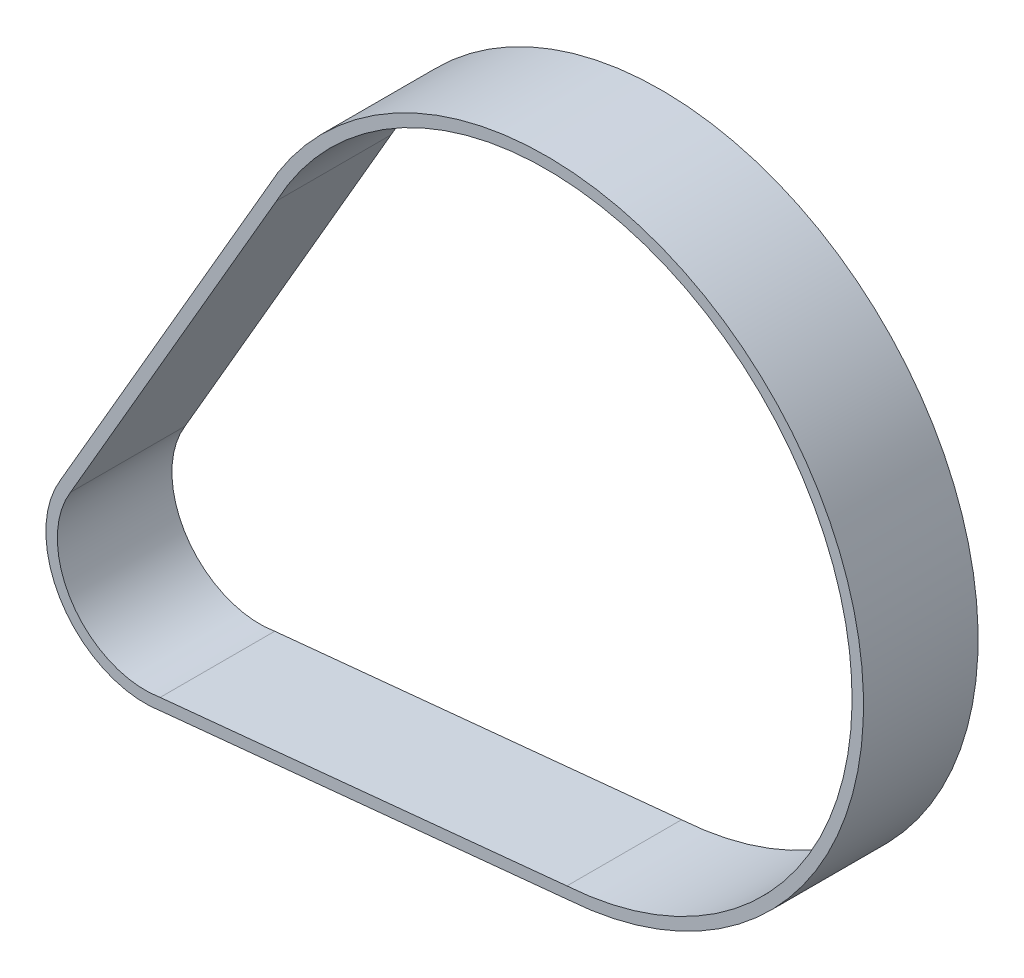
ISO-10303-21;
HEADER;
FILE_DESCRIPTION(('STEP AP214'),'2;1');
FILE_NAME('part.step','',(''),(''),'','','');
FILE_SCHEMA(('AUTOMOTIVE_DESIGN { 1 0 10303 214 1 1 1 1 }'));
ENDSEC;
DATA;
#1=APPLICATION_CONTEXT('core data for automotive mechanical design processes');
#2=APPLICATION_PROTOCOL_DEFINITION('international standard','automotive_design',2000,#1);
#3=PRODUCT_CONTEXT('',#1,'mechanical');
#4=PRODUCT('Part','Part','',(#3));
#5=PRODUCT_RELATED_PRODUCT_CATEGORY('part','',(#4));
#6=PRODUCT_DEFINITION_FORMATION('','',#4);
#7=PRODUCT_DEFINITION_CONTEXT('part definition',#1,'design');
#8=PRODUCT_DEFINITION('design','',#6,#7);
#9=PRODUCT_DEFINITION_SHAPE('','',#8);
#10=(LENGTH_UNIT() NAMED_UNIT(*) SI_UNIT(.MILLI.,.METRE.));
#11=(NAMED_UNIT(*) PLANE_ANGLE_UNIT() SI_UNIT($,.RADIAN.));
#12=(NAMED_UNIT(*) SI_UNIT($,.STERADIAN.) SOLID_ANGLE_UNIT());
#13=UNCERTAINTY_MEASURE_WITH_UNIT(LENGTH_MEASURE(1.E-05),#10,'distance_accuracy_value','');
#14=(GEOMETRIC_REPRESENTATION_CONTEXT(3) GLOBAL_UNCERTAINTY_ASSIGNED_CONTEXT((#13)) GLOBAL_UNIT_ASSIGNED_CONTEXT((#10,
#11,#12)) REPRESENTATION_CONTEXT('',''));
#15=CARTESIAN_POINT('',(0.,0.,0.));
#16=DIRECTION('',(0.,0.,1.));
#17=DIRECTION('',(1.,0.,0.));
#18=AXIS2_PLACEMENT_3D('',#15,#16,#17);
#19=CARTESIAN_POINT('',(0.,0.,15.));
#20=DIRECTION('',(0.,0.,1.));
#21=DIRECTION('',(1.,0.,0.));
#22=AXIS2_PLACEMENT_3D('',#19,#20,#21);
#23=PLANE('',#22);
#24=CARTESIAN_POINT('',(0.,0.,15.));
#25=DIRECTION('',(0.,0.,1.));
#26=DIRECTION('',(1.,0.,0.));
#27=AXIS2_PLACEMENT_3D('',#24,#25,#26);
#28=CIRCLE('',#27,13.);
#29=CARTESIAN_POINT('',(-11.0755055278816,6.80684782420347,15.));
#30=VERTEX_POINT('',#29);
#31=CARTESIAN_POINT('',(2.16100902586993,-12.8191278950679,15.));
#32=VERTEX_POINT('',#31);
#33=EDGE_CURVE('E153',#30,#32,#28,.T.);
#34=ORIENTED_EDGE('',*,*,#33,.T.);
#35=DIRECTION('',(0.995168514034322,0.0981816106749091,0.));
#36=VECTOR('',#35,1.);
#37=CARTESIAN_POINT('',(55.3313003015655,-7.57343858327584,15.));
#38=LINE('',#37,#36);
#39=CARTESIAN_POINT('',(55.3313003015655,-7.57343858327585,15.));
#40=VERTEX_POINT('',#39);
#41=EDGE_CURVE('E157',#32,#40,#38,.T.);
#42=ORIENTED_EDGE('',*,*,#41,.T.);
#43=CARTESIAN_POINT('',(52.5312535081296,33.8319926782697,15.));
#44=DIRECTION('',(0.,0.,1.));
#45=DIRECTION('',(1.,0.,0.));
#46=AXIS2_PLACEMENT_3D('',#43,#44,#45);
#47=CIRCLE('',#46,41.5);
#48=CARTESIAN_POINT('',(15.8692170701721,53.2779455791146,15.));
#49=VERTEX_POINT('',#48);
#50=EDGE_CURVE('E161',#40,#49,#47,.T.);
#51=ORIENTED_EDGE('',*,*,#50,.T.);
#52=DIRECTION('',(-0.501599484798106,-0.865099969281166,0.));
#53=VECTOR('',#52,1.);
#54=CARTESIAN_POINT('',(-11.0755055278816,6.80684782420347,15.));
#55=LINE('',#54,#53);
#56=EDGE_CURVE('E164',#49,#30,#55,.T.);
#57=ORIENTED_EDGE('',*,*,#56,.T.);
#58=EDGE_LOOP('',(#34,#42,#51,#57));
#59=FACE_BOUND('',#58,.T.);
#60=DIRECTION('',(0.995168514034322,0.0981816106749091,0.));
#61=VECTOR('',#60,1.);
#62=CARTESIAN_POINT('',(55.2072430923386,-6.0783954399284,15.));
#63=LINE('',#62,#61);
#64=CARTESIAN_POINT('',(1.96089229816123,-11.3315886527447,15.));
#65=VERTEX_POINT('',#64);
#66=CARTESIAN_POINT('',(55.2072430923386,-6.07839543992839,15.));
#67=VERTEX_POINT('',#66);
#68=EDGE_CURVE('E114',#65,#67,#63,.T.);
#69=ORIENTED_EDGE('',*,*,#68,.F.);
#70=CARTESIAN_POINT('',(0.,0.,15.));
#71=DIRECTION('',(0.,0.,1.));
#72=DIRECTION('',(1.,0.,0.));
#73=AXIS2_PLACEMENT_3D('',#70,#71,#72);
#74=CIRCLE('',#73,11.5);
#75=CARTESIAN_POINT('',(-9.78779308237401,6.03730954785585,15.));
#76=VERTEX_POINT('',#75);
#77=EDGE_CURVE('E105',#76,#65,#74,.T.);
#78=ORIENTED_EDGE('',*,*,#77,.F.);
#79=DIRECTION('',(-0.501599484798106,-0.865099969281166,0.));
#80=VECTOR('',#79,1.);
#81=CARTESIAN_POINT('',(-9.78779308237401,6.03730954785585,15.));
#82=LINE('',#81,#80);
#83=CARTESIAN_POINT('',(17.1812075336384,52.5502791810817,15.));
#84=VERTEX_POINT('',#83);
#85=EDGE_CURVE('E131',#84,#76,#82,.T.);
#86=ORIENTED_EDGE('',*,*,#85,.F.);
#87=CARTESIAN_POINT('',(52.5312535081296,33.8319926782697,15.));
#88=DIRECTION('',(0.,0.,1.));
#89=DIRECTION('',(1.,0.,0.));
#90=AXIS2_PLACEMENT_3D('',#87,#88,#89);
#91=CIRCLE('',#90,40.);
#92=EDGE_CURVE('E127',#67,#84,#91,.T.);
#93=ORIENTED_EDGE('',*,*,#92,.F.);
#94=EDGE_LOOP('',(#69,#78,#86,#93));
#95=FACE_BOUND('',#94,.T.);
#96=ADVANCED_FACE('F39',(#59,#95),#23,.T.);
#97=CARTESIAN_POINT('',(0.,0.,0.));
#98=DIRECTION('',(0.,0.,1.));
#99=DIRECTION('',(1.,0.,0.));
#100=AXIS2_PLACEMENT_3D('',#97,#98,#99);
#101=PLANE('',#100);
#102=CARTESIAN_POINT('',(0.,0.,0.));
#103=DIRECTION('',(0.,0.,1.));
#104=DIRECTION('',(1.,0.,0.));
#105=AXIS2_PLACEMENT_3D('',#102,#103,#104);
#106=CIRCLE('',#105,13.);
#107=CARTESIAN_POINT('',(-11.0755055278816,6.80684782420347,0.));
#108=VERTEX_POINT('',#107);
#109=CARTESIAN_POINT('',(2.16100902586993,-12.8191278950679,0.));
#110=VERTEX_POINT('',#109);
#111=EDGE_CURVE('E123',#108,#110,#106,.T.);
#112=ORIENTED_EDGE('',*,*,#111,.F.);
#113=DIRECTION('',(-0.501599484798106,-0.865099969281166,0.));
#114=VECTOR('',#113,1.);
#115=CARTESIAN_POINT('',(-11.0755055278816,6.80684782420347,0.));
#116=LINE('',#115,#114);
#117=CARTESIAN_POINT('',(15.8692170701721,53.2779455791146,0.));
#118=VERTEX_POINT('',#117);
#119=EDGE_CURVE('E158',#118,#108,#116,.T.);
#120=ORIENTED_EDGE('',*,*,#119,.F.);
#121=CARTESIAN_POINT('',(52.5312535081296,33.8319926782697,0.));
#122=DIRECTION('',(0.,0.,1.));
#123=DIRECTION('',(1.,0.,0.));
#124=AXIS2_PLACEMENT_3D('',#121,#122,#123);
#125=CIRCLE('',#124,41.5);
#126=CARTESIAN_POINT('',(55.3313003015655,-7.57343858327585,0.));
#127=VERTEX_POINT('',#126);
#128=EDGE_CURVE('E174',#127,#118,#125,.T.);
#129=ORIENTED_EDGE('',*,*,#128,.F.);
#130=DIRECTION('',(0.995168514034322,0.0981816106749091,0.));
#131=VECTOR('',#130,1.);
#132=CARTESIAN_POINT('',(55.3313003015655,-7.57343858327584,0.));
#133=LINE('',#132,#131);
#134=EDGE_CURVE('E171',#110,#127,#133,.T.);
#135=ORIENTED_EDGE('',*,*,#134,.F.);
#136=EDGE_LOOP('',(#112,#120,#129,#135));
#137=FACE_BOUND('',#136,.T.);
#138=CARTESIAN_POINT('',(0.,0.,0.));
#139=DIRECTION('',(0.,0.,1.));
#140=DIRECTION('',(1.,0.,0.));
#141=AXIS2_PLACEMENT_3D('',#138,#139,#140);
#142=CIRCLE('',#141,11.5);
#143=CARTESIAN_POINT('',(-9.78779308237401,6.03730954785585,0.));
#144=VERTEX_POINT('',#143);
#145=CARTESIAN_POINT('',(1.96089229816123,-11.3315886527447,0.));
#146=VERTEX_POINT('',#145);
#147=EDGE_CURVE('E63',#144,#146,#142,.T.);
#148=ORIENTED_EDGE('',*,*,#147,.T.);
#149=DIRECTION('',(0.995168514034322,0.0981816106749091,0.));
#150=VECTOR('',#149,1.);
#151=CARTESIAN_POINT('',(55.2072430923386,-6.0783954399284,0.));
#152=LINE('',#151,#150);
#153=CARTESIAN_POINT('',(55.2072430923386,-6.07839543992839,0.));
#154=VERTEX_POINT('',#153);
#155=EDGE_CURVE('E121',#146,#154,#152,.T.);
#156=ORIENTED_EDGE('',*,*,#155,.T.);
#157=CARTESIAN_POINT('',(52.5312535081296,33.8319926782697,0.));
#158=DIRECTION('',(0.,0.,1.));
#159=DIRECTION('',(1.,0.,0.));
#160=AXIS2_PLACEMENT_3D('',#157,#158,#159);
#161=CIRCLE('',#160,40.);
#162=CARTESIAN_POINT('',(17.1812075336384,52.5502791810817,0.));
#163=VERTEX_POINT('',#162);
#164=EDGE_CURVE('E140',#154,#163,#161,.T.);
#165=ORIENTED_EDGE('',*,*,#164,.T.);
#166=DIRECTION('',(-0.501599484798106,-0.865099969281166,0.));
#167=VECTOR('',#166,1.);
#168=CARTESIAN_POINT('',(-9.78779308237401,6.03730954785585,0.));
#169=LINE('',#168,#167);
#170=EDGE_CURVE('E115',#163,#144,#169,.T.);
#171=ORIENTED_EDGE('',*,*,#170,.T.);
#172=EDGE_LOOP('',(#148,#156,#165,#171));
#173=FACE_BOUND('',#172,.T.);
#174=ADVANCED_FACE('F197',(#137,#173),#101,.F.);
#175=CARTESIAN_POINT('',(0.,0.,15.));
#176=DIRECTION('',(0.,0.,-1.));
#177=DIRECTION('',(-1.,0.,0.));
#178=AXIS2_PLACEMENT_3D('',#175,#176,#177);
#179=CYLINDRICAL_SURFACE('',#178,13.);
#180=ORIENTED_EDGE('',*,*,#111,.T.);
#181=DIRECTION('',(0.,0.,-1.));
#182=VECTOR('',#181,1.);
#183=CARTESIAN_POINT('',(2.16100902586993,-12.8191278950679,15.));
#184=LINE('',#183,#182);
#185=EDGE_CURVE('E11',#32,#110,#184,.T.);
#186=ORIENTED_EDGE('',*,*,#185,.F.);
#187=ORIENTED_EDGE('',*,*,#33,.F.);
#188=DIRECTION('',(0.,0.,-1.));
#189=VECTOR('',#188,1.);
#190=CARTESIAN_POINT('',(-11.0755055278816,6.80684782420347,15.));
#191=LINE('',#190,#189);
#192=EDGE_CURVE('E167',#30,#108,#191,.T.);
#193=ORIENTED_EDGE('',*,*,#192,.T.);
#194=EDGE_LOOP('',(#180,#186,#187,#193));
#195=FACE_BOUND('',#194,.T.);
#196=ADVANCED_FACE('F41',(#195),#179,.T.);
#197=CARTESIAN_POINT('',(55.3313003015655,-7.57343858327584,15.));
#198=DIRECTION('',(-0.0981816106749091,0.995168514034322,0.));
#199=DIRECTION('',(-0.995168514034322,-0.0981816106749091,0.));
#200=AXIS2_PLACEMENT_3D('',#197,#198,#199);
#201=PLANE('',#200);
#202=ORIENTED_EDGE('',*,*,#134,.T.);
#203=DIRECTION('',(0.,0.,-1.));
#204=VECTOR('',#203,1.);
#205=CARTESIAN_POINT('',(55.3313003015655,-7.57343858327585,15.));
#206=LINE('',#205,#204);
#207=EDGE_CURVE('E48',#40,#127,#206,.T.);
#208=ORIENTED_EDGE('',*,*,#207,.F.);
#209=ORIENTED_EDGE('',*,*,#41,.F.);
#210=ORIENTED_EDGE('',*,*,#185,.T.);
#211=EDGE_LOOP('',(#202,#208,#209,#210));
#212=FACE_BOUND('',#211,.T.);
#213=ADVANCED_FACE('F207',(#212),#201,.F.);
#214=CARTESIAN_POINT('',(52.5312535081296,33.8319926782697,15.));
#215=DIRECTION('',(0.,0.,-1.));
#216=DIRECTION('',(-1.,0.,0.));
#217=AXIS2_PLACEMENT_3D('',#214,#215,#216);
#218=CYLINDRICAL_SURFACE('',#217,41.5);
#219=ORIENTED_EDGE('',*,*,#128,.T.);
#220=DIRECTION('',(0.,0.,-1.));
#221=VECTOR('',#220,1.);
#222=CARTESIAN_POINT('',(15.8692170701721,53.2779455791146,15.));
#223=LINE('',#222,#221);
#224=EDGE_CURVE('E182',#49,#118,#223,.T.);
#225=ORIENTED_EDGE('',*,*,#224,.F.);
#226=ORIENTED_EDGE('',*,*,#50,.F.);
#227=ORIENTED_EDGE('',*,*,#207,.T.);
#228=EDGE_LOOP('',(#219,#225,#226,#227));
#229=FACE_BOUND('',#228,.T.);
#230=ADVANCED_FACE('F191',(#229),#218,.T.);
#231=CARTESIAN_POINT('',(-11.0755055278816,6.80684782420347,15.));
#232=DIRECTION('',(0.865099969281166,-0.501599484798106,0.));
#233=DIRECTION('',(0.501599484798106,0.865099969281166,0.));
#234=AXIS2_PLACEMENT_3D('',#231,#232,#233);
#235=PLANE('',#234);
#236=ORIENTED_EDGE('',*,*,#119,.T.);
#237=ORIENTED_EDGE('',*,*,#192,.F.);
#238=ORIENTED_EDGE('',*,*,#56,.F.);
#239=ORIENTED_EDGE('',*,*,#224,.T.);
#240=EDGE_LOOP('',(#236,#237,#238,#239));
#241=FACE_BOUND('',#240,.T.);
#242=ADVANCED_FACE('F201',(#241),#235,.F.);
#243=CARTESIAN_POINT('',(0.,0.,15.));
#244=DIRECTION('',(0.,0.,-1.));
#245=DIRECTION('',(-1.,0.,0.));
#246=AXIS2_PLACEMENT_3D('',#243,#244,#245);
#247=CYLINDRICAL_SURFACE('',#246,11.5);
#248=ORIENTED_EDGE('',*,*,#147,.F.);
#249=DIRECTION('',(0.,0.,-1.));
#250=VECTOR('',#249,1.);
#251=CARTESIAN_POINT('',(-9.78779308237401,6.03730954785585,15.));
#252=LINE('',#251,#250);
#253=EDGE_CURVE('E109',#76,#144,#252,.T.);
#254=ORIENTED_EDGE('',*,*,#253,.F.);
#255=ORIENTED_EDGE('',*,*,#77,.T.);
#256=DIRECTION('',(0.,0.,-1.));
#257=VECTOR('',#256,1.);
#258=CARTESIAN_POINT('',(1.96089229816123,-11.3315886527447,15.));
#259=LINE('',#258,#257);
#260=EDGE_CURVE('E108',#65,#146,#259,.T.);
#261=ORIENTED_EDGE('',*,*,#260,.T.);
#262=EDGE_LOOP('',(#248,#254,#255,#261));
#263=FACE_BOUND('',#262,.T.);
#264=ADVANCED_FACE('F107',(#263),#247,.F.);
#265=CARTESIAN_POINT('',(55.2072430923386,-6.0783954399284,15.));
#266=DIRECTION('',(-0.0981816106749091,0.995168514034322,0.));
#267=DIRECTION('',(-0.995168514034322,-0.0981816106749091,0.));
#268=AXIS2_PLACEMENT_3D('',#265,#266,#267);
#269=PLANE('',#268);
#270=ORIENTED_EDGE('',*,*,#155,.F.);
#271=ORIENTED_EDGE('',*,*,#260,.F.);
#272=ORIENTED_EDGE('',*,*,#68,.T.);
#273=DIRECTION('',(0.,0.,-1.));
#274=VECTOR('',#273,1.);
#275=CARTESIAN_POINT('',(55.2072430923386,-6.07839543992839,15.));
#276=LINE('',#275,#274);
#277=EDGE_CURVE('E124',#67,#154,#276,.T.);
#278=ORIENTED_EDGE('',*,*,#277,.T.);
#279=EDGE_LOOP('',(#270,#271,#272,#278));
#280=FACE_BOUND('',#279,.T.);
#281=ADVANCED_FACE('F118',(#280),#269,.T.);
#282=CARTESIAN_POINT('',(52.5312535081296,33.8319926782697,15.));
#283=DIRECTION('',(0.,0.,-1.));
#284=DIRECTION('',(-1.,0.,0.));
#285=AXIS2_PLACEMENT_3D('',#282,#283,#284);
#286=CYLINDRICAL_SURFACE('',#285,40.);
#287=ORIENTED_EDGE('',*,*,#164,.F.);
#288=ORIENTED_EDGE('',*,*,#277,.F.);
#289=ORIENTED_EDGE('',*,*,#92,.T.);
#290=DIRECTION('',(0.,0.,-1.));
#291=VECTOR('',#290,1.);
#292=CARTESIAN_POINT('',(17.1812075336384,52.5502791810817,15.));
#293=LINE('',#292,#291);
#294=EDGE_CURVE('E55',#84,#163,#293,.T.);
#295=ORIENTED_EDGE('',*,*,#294,.T.);
#296=EDGE_LOOP('',(#287,#288,#289,#295));
#297=FACE_BOUND('',#296,.T.);
#298=ADVANCED_FACE('F230',(#297),#286,.F.);
#299=CARTESIAN_POINT('',(-9.78779308237401,6.03730954785585,15.));
#300=DIRECTION('',(0.865099969281166,-0.501599484798106,0.));
#301=DIRECTION('',(0.501599484798106,0.865099969281166,0.));
#302=AXIS2_PLACEMENT_3D('',#299,#300,#301);
#303=PLANE('',#302);
#304=ORIENTED_EDGE('',*,*,#170,.F.);
#305=ORIENTED_EDGE('',*,*,#294,.F.);
#306=ORIENTED_EDGE('',*,*,#85,.T.);
#307=ORIENTED_EDGE('',*,*,#253,.T.);
#308=EDGE_LOOP('',(#304,#305,#306,#307));
#309=FACE_BOUND('',#308,.T.);
#310=ADVANCED_FACE('F234',(#309),#303,.T.);
#311=CLOSED_SHELL('',(#96,#174,#196,#213,#230,#242,#264,#281,#298,#310));
#312=MANIFOLD_SOLID_BREP('B2',#311);
#313=ADVANCED_BREP_SHAPE_REPRESENTATION('',(#18,#312),#14);
#314=SHAPE_DEFINITION_REPRESENTATION(#9,#313);
ENDSEC;
END-ISO-10303-21;
